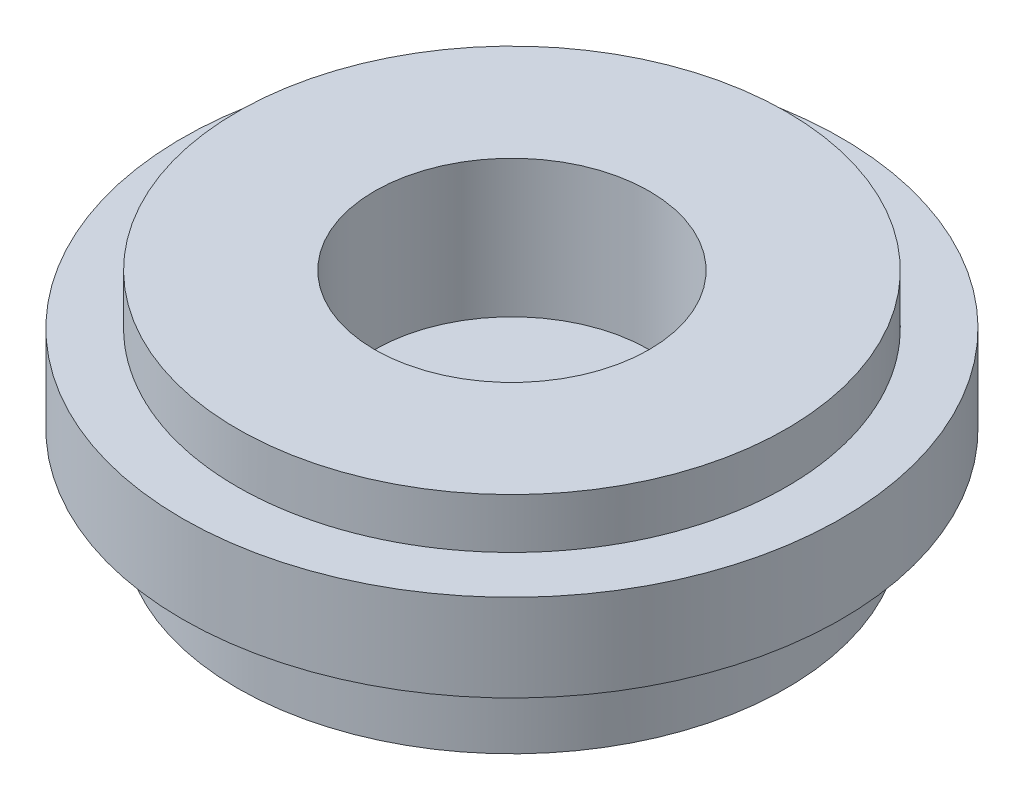
ISO-10303-21;
HEADER;
FILE_DESCRIPTION(('STEP AP214'),'2;1');
FILE_NAME('part.step','',(''),(''),'','','');
FILE_SCHEMA(('AUTOMOTIVE_DESIGN { 1 0 10303 214 1 1 1 1 }'));
ENDSEC;
DATA;
#1=APPLICATION_CONTEXT('core data for automotive mechanical design processes');
#2=APPLICATION_PROTOCOL_DEFINITION('international standard','automotive_design',2000,#1);
#3=PRODUCT_CONTEXT('',#1,'mechanical');
#4=PRODUCT('Part','Part','',(#3));
#5=PRODUCT_RELATED_PRODUCT_CATEGORY('part','',(#4));
#6=PRODUCT_DEFINITION_FORMATION('','',#4);
#7=PRODUCT_DEFINITION_CONTEXT('part definition',#1,'design');
#8=PRODUCT_DEFINITION('design','',#6,#7);
#9=PRODUCT_DEFINITION_SHAPE('','',#8);
#10=(LENGTH_UNIT() NAMED_UNIT(*) SI_UNIT(.MILLI.,.METRE.));
#11=(NAMED_UNIT(*) PLANE_ANGLE_UNIT() SI_UNIT($,.RADIAN.));
#12=(NAMED_UNIT(*) SI_UNIT($,.STERADIAN.) SOLID_ANGLE_UNIT());
#13=UNCERTAINTY_MEASURE_WITH_UNIT(LENGTH_MEASURE(1.E-05),#10,'distance_accuracy_value','');
#14=(GEOMETRIC_REPRESENTATION_CONTEXT(3) GLOBAL_UNCERTAINTY_ASSIGNED_CONTEXT((#13)) GLOBAL_UNIT_ASSIGNED_CONTEXT((#10,
#11,#12)) REPRESENTATION_CONTEXT('',''));
#15=CARTESIAN_POINT('',(0.,0.,0.));
#16=DIRECTION('',(0.,0.,1.));
#17=DIRECTION('',(1.,0.,0.));
#18=AXIS2_PLACEMENT_3D('',#15,#16,#17);
#19=CARTESIAN_POINT('',(0.,3.175,0.));
#20=DIRECTION('',(0.,1.,0.));
#21=DIRECTION('',(0.,0.,1.));
#22=AXIS2_PLACEMENT_3D('',#19,#20,#21);
#23=PLANE('',#22);
#24=CARTESIAN_POINT('',(0.,3.175,0.));
#25=DIRECTION('',(0.,1.,0.));
#26=DIRECTION('',(0.,0.,1.));
#27=AXIS2_PLACEMENT_3D('',#24,#25,#26);
#28=CIRCLE('',#27,6.);
#29=CARTESIAN_POINT('',(0.,3.175,6.));
#30=VERTEX_POINT('',#29);
#31=EDGE_CURVE('E11',#30,#30,#28,.T.);
#32=ORIENTED_EDGE('',*,*,#31,.T.);
#33=EDGE_LOOP('',(#32));
#34=FACE_BOUND('',#33,.T.);
#35=CARTESIAN_POINT('',(0.,3.175,0.));
#36=DIRECTION('',(0.,1.,0.));
#37=DIRECTION('',(0.,0.,1.));
#38=AXIS2_PLACEMENT_3D('',#35,#36,#37);
#39=CIRCLE('',#38,5.);
#40=CARTESIAN_POINT('',(0.,3.175,5.));
#41=VERTEX_POINT('',#40);
#42=EDGE_CURVE('E60',#41,#41,#39,.T.);
#43=ORIENTED_EDGE('',*,*,#42,.F.);
#44=EDGE_LOOP('',(#43));
#45=FACE_BOUND('',#44,.T.);
#46=ADVANCED_FACE('F49',(#34,#45),#23,.T.);
#47=CARTESIAN_POINT('',(0.,1.5875,0.));
#48=DIRECTION('',(0.,1.,0.));
#49=DIRECTION('',(0.,0.,1.));
#50=AXIS2_PLACEMENT_3D('',#47,#48,#49);
#51=PLANE('',#50);
#52=CARTESIAN_POINT('',(0.,1.5875,0.));
#53=DIRECTION('',(0.,1.,0.));
#54=DIRECTION('',(0.,0.,1.));
#55=AXIS2_PLACEMENT_3D('',#52,#53,#54);
#56=CIRCLE('',#55,6.);
#57=CARTESIAN_POINT('',(0.,1.5875,6.));
#58=VERTEX_POINT('',#57);
#59=EDGE_CURVE('E53',#58,#58,#56,.T.);
#60=ORIENTED_EDGE('',*,*,#59,.F.);
#61=EDGE_LOOP('',(#60));
#62=FACE_BOUND('',#61,.T.);
#63=CARTESIAN_POINT('',(0.,1.5875,0.));
#64=DIRECTION('',(0.,1.,0.));
#65=DIRECTION('',(0.,0.,1.));
#66=AXIS2_PLACEMENT_3D('',#63,#64,#65);
#67=CIRCLE('',#66,5.);
#68=CARTESIAN_POINT('',(0.,1.5875,5.));
#69=VERTEX_POINT('',#68);
#70=EDGE_CURVE('E62',#69,#69,#67,.T.);
#71=ORIENTED_EDGE('',*,*,#70,.T.);
#72=EDGE_LOOP('',(#71));
#73=FACE_BOUND('',#72,.T.);
#74=ADVANCED_FACE('F72',(#62,#73),#51,.F.);
#75=CARTESIAN_POINT('',(0.,3.175,0.));
#76=DIRECTION('',(0.,-1.,0.));
#77=DIRECTION('',(0.,0.,-1.));
#78=AXIS2_PLACEMENT_3D('',#75,#76,#77);
#79=CYLINDRICAL_SURFACE('',#78,6.);
#80=ORIENTED_EDGE('',*,*,#31,.F.);
#81=EDGE_LOOP('',(#80));
#82=FACE_BOUND('',#81,.T.);
#83=ORIENTED_EDGE('',*,*,#59,.T.);
#84=EDGE_LOOP('',(#83));
#85=FACE_BOUND('',#84,.T.);
#86=ADVANCED_FACE('F51',(#82,#85),#79,.T.);
#87=CARTESIAN_POINT('',(0.,3.175,0.));
#88=DIRECTION('',(0.,-1.,0.));
#89=DIRECTION('',(0.,0.,-1.));
#90=AXIS2_PLACEMENT_3D('',#87,#88,#89);
#91=CYLINDRICAL_SURFACE('',#90,5.);
#92=ORIENTED_EDGE('',*,*,#42,.T.);
#93=EDGE_LOOP('',(#92));
#94=FACE_BOUND('',#93,.T.);
#95=ORIENTED_EDGE('',*,*,#70,.F.);
#96=EDGE_LOOP('',(#95));
#97=FACE_BOUND('',#96,.T.);
#98=ADVANCED_FACE('F68',(#94,#97),#91,.F.);
#99=CLOSED_SHELL('',(#46,#74,#86,#98));
#100=MANIFOLD_SOLID_BREP('B2',#99);
#101=CARTESIAN_POINT('',(0.,1.5875,0.));
#102=DIRECTION('',(0.,-1.,0.));
#103=DIRECTION('',(0.,0.,-1.));
#104=AXIS2_PLACEMENT_3D('',#101,#102,#103);
#105=CYLINDRICAL_SURFACE('',#104,5.);
#106=CARTESIAN_POINT('',(0.,0.,0.));
#107=DIRECTION('',(0.,1.,0.));
#108=DIRECTION('',(0.,0.,1.));
#109=AXIS2_PLACEMENT_3D('',#106,#107,#108);
#110=CIRCLE('',#109,5.);
#111=CARTESIAN_POINT('',(0.,0.,5.));
#112=VERTEX_POINT('',#111);
#113=EDGE_CURVE('E117',#112,#112,#110,.T.);
#114=ORIENTED_EDGE('',*,*,#113,.T.);
#115=EDGE_LOOP('',(#114));
#116=FACE_BOUND('',#115,.T.);
#117=CARTESIAN_POINT('',(0.,4.08750000000001,0.));
#118=DIRECTION('',(0.,-1.,0.));
#119=DIRECTION('',(0.,0.,-1.));
#120=AXIS2_PLACEMENT_3D('',#117,#118,#119);
#121=CIRCLE('',#120,5.);
#122=CARTESIAN_POINT('',(0.,4.08750000000001,-5.));
#123=VERTEX_POINT('',#122);
#124=EDGE_CURVE('E125',#123,#123,#121,.T.);
#125=ORIENTED_EDGE('',*,*,#124,.T.);
#126=EDGE_LOOP('',(#125));
#127=FACE_BOUND('',#126,.T.);
#128=ADVANCED_FACE('F111',(#116,#127),#105,.T.);
#129=CARTESIAN_POINT('',(0.,0.,0.));
#130=DIRECTION('',(0.,1.,0.));
#131=DIRECTION('',(0.,0.,1.));
#132=AXIS2_PLACEMENT_3D('',#129,#130,#131);
#133=PLANE('',#132);
#134=ORIENTED_EDGE('',*,*,#113,.F.);
#135=EDGE_LOOP('',(#134));
#136=FACE_BOUND('',#135,.T.);
#137=ADVANCED_FACE('F144',(#136),#133,.F.);
#138=CARTESIAN_POINT('',(0.,18.229635623731,0.));
#139=DIRECTION('',(0.,-1.,0.));
#140=DIRECTION('',(0.,0.,-1.));
#141=AXIS2_PLACEMENT_3D('',#138,#139,#140);
#142=CYLINDRICAL_SURFACE('',#141,2.5);
#143=CARTESIAN_POINT('',(0.,4.08750000000001,0.));
#144=DIRECTION('',(0.,-1.,0.));
#145=DIRECTION('',(0.,0.,-1.));
#146=AXIS2_PLACEMENT_3D('',#143,#144,#145);
#147=CIRCLE('',#146,2.5);
#148=CARTESIAN_POINT('',(0.,4.08750000000001,-2.5));
#149=VERTEX_POINT('',#148);
#150=EDGE_CURVE('E121',#149,#149,#147,.T.);
#151=ORIENTED_EDGE('',*,*,#150,.F.);
#152=EDGE_LOOP('',(#151));
#153=FACE_BOUND('',#152,.T.);
#154=CARTESIAN_POINT('',(0.,1.5875,0.));
#155=DIRECTION('',(0.,1.,0.));
#156=DIRECTION('',(0.,0.,1.));
#157=AXIS2_PLACEMENT_3D('',#154,#155,#156);
#158=CIRCLE('',#157,2.5);
#159=CARTESIAN_POINT('',(0.,1.5875,2.5));
#160=VERTEX_POINT('',#159);
#161=EDGE_CURVE('E48',#160,#160,#158,.F.);
#162=ORIENTED_EDGE('',*,*,#161,.T.);
#163=EDGE_LOOP('',(#162));
#164=FACE_BOUND('',#163,.T.);
#165=ADVANCED_FACE('F135',(#153,#164),#142,.F.);
#166=CARTESIAN_POINT('',(0.,4.08750000000001,0.));
#167=DIRECTION('',(0.,-1.,0.));
#168=DIRECTION('',(-0.911032738537194,0.,0.412334026383247));
#169=AXIS2_PLACEMENT_3D('',#166,#167,#168);
#170=PLANE('',#169);
#171=ORIENTED_EDGE('',*,*,#150,.T.);
#172=EDGE_LOOP('',(#171));
#173=FACE_BOUND('',#172,.T.);
#174=ORIENTED_EDGE('',*,*,#124,.F.);
#175=EDGE_LOOP('',(#174));
#176=FACE_BOUND('',#175,.T.);
#177=ADVANCED_FACE('F132',(#173,#176),#170,.F.);
#178=CARTESIAN_POINT('',(0.,1.5875,0.));
#179=DIRECTION('',(0.,1.,0.));
#180=DIRECTION('',(0.,0.,1.));
#181=AXIS2_PLACEMENT_3D('',#178,#179,#180);
#182=PLANE('',#181);
#183=ORIENTED_EDGE('',*,*,#161,.F.);
#184=EDGE_LOOP('',(#183));
#185=FACE_BOUND('',#184,.T.);
#186=ADVANCED_FACE('F134',(#185),#182,.T.);
#187=CLOSED_SHELL('',(#128,#137,#165,#177,#186));
#188=MANIFOLD_SOLID_BREP('B6',#187);
#189=ADVANCED_BREP_SHAPE_REPRESENTATION('',(#18,#100,#188),#14);
#190=SHAPE_DEFINITION_REPRESENTATION(#9,#189);
ENDSEC;
END-ISO-10303-21;
